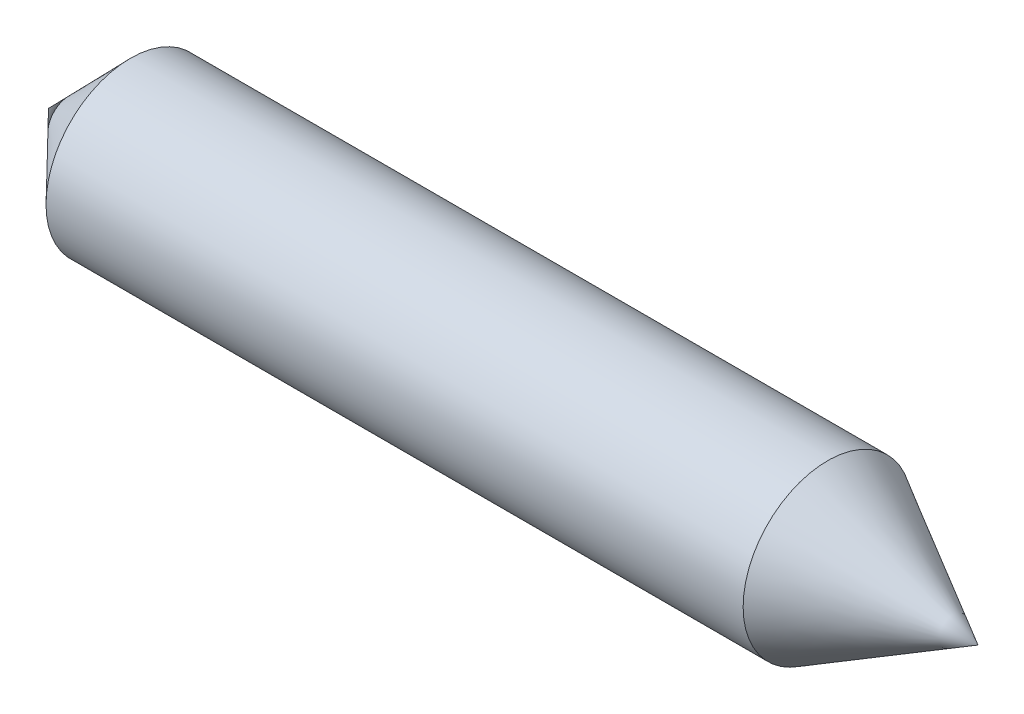
ISO-10303-21;
HEADER;
FILE_DESCRIPTION(('STEP AP214'),'2;1');
FILE_NAME('part.step','',(''),(''),'','','');
FILE_SCHEMA(('AUTOMOTIVE_DESIGN { 1 0 10303 214 1 1 1 1 }'));
ENDSEC;
DATA;
#1=APPLICATION_CONTEXT('core data for automotive mechanical design processes');
#2=APPLICATION_PROTOCOL_DEFINITION('international standard','automotive_design',2000,#1);
#3=PRODUCT_CONTEXT('',#1,'mechanical');
#4=PRODUCT('Part','Part','',(#3));
#5=PRODUCT_RELATED_PRODUCT_CATEGORY('part','',(#4));
#6=PRODUCT_DEFINITION_FORMATION('','',#4);
#7=PRODUCT_DEFINITION_CONTEXT('part definition',#1,'design');
#8=PRODUCT_DEFINITION('design','',#6,#7);
#9=PRODUCT_DEFINITION_SHAPE('','',#8);
#10=(LENGTH_UNIT() NAMED_UNIT(*) SI_UNIT(.MILLI.,.METRE.));
#11=(NAMED_UNIT(*) PLANE_ANGLE_UNIT() SI_UNIT($,.RADIAN.));
#12=(NAMED_UNIT(*) SI_UNIT($,.STERADIAN.) SOLID_ANGLE_UNIT());
#13=UNCERTAINTY_MEASURE_WITH_UNIT(LENGTH_MEASURE(1.E-05),#10,'distance_accuracy_value','');
#14=(GEOMETRIC_REPRESENTATION_CONTEXT(3) GLOBAL_UNCERTAINTY_ASSIGNED_CONTEXT((#13)) GLOBAL_UNIT_ASSIGNED_CONTEXT((#10,
#11,#12)) REPRESENTATION_CONTEXT('',''));
#15=CARTESIAN_POINT('',(0.,0.,0.));
#16=DIRECTION('',(0.,0.,1.));
#17=DIRECTION('',(1.,0.,0.));
#18=AXIS2_PLACEMENT_3D('',#15,#16,#17);
#19=CARTESIAN_POINT('',(-61.4092595220045,7.18483976992605,0.));
#20=DIRECTION('',(1.,0.,0.));
#21=DIRECTION('',(0.,0.,-1.));
#22=AXIS2_PLACEMENT_3D('',#19,#20,#21);
#23=CONICAL_SURFACE('',#22,18.178462804953,0.800319841448886);
#24=CARTESIAN_POINT('',(-79.0531529840006,7.18483976992605,0.));
#25=VERTEX_POINT('',#24);
#26=VERTEX_LOOP('',#25);
#27=FACE_BOUND('',#26,.T.);
#28=CARTESIAN_POINT('',(-61.4092595220045,7.18483976992605,0.));
#29=DIRECTION('',(-1.,0.,0.));
#30=DIRECTION('',(0.,0.,1.));
#31=AXIS2_PLACEMENT_3D('',#28,#29,#30);
#32=CIRCLE('',#31,18.178462804953);
#33=CARTESIAN_POINT('',(-61.4092595220045,7.18483976992605,18.178462804953));
#34=VERTEX_POINT('',#33);
#35=EDGE_CURVE('E11',#34,#34,#32,.T.);
#36=ORIENTED_EDGE('',*,*,#35,.T.);
#37=EDGE_LOOP('',(#36));
#38=FACE_BOUND('',#37,.T.);
#39=ADVANCED_FACE('F35',(#27,#38),#23,.T.);
#40=CARTESIAN_POINT('',(-79.0531529840006,7.18483976992605,0.));
#41=DIRECTION('',(-1.,0.,0.));
#42=DIRECTION('',(0.,0.,1.));
#43=AXIS2_PLACEMENT_3D('',#40,#41,#42);
#44=CYLINDRICAL_SURFACE('',#43,18.178462804953);
#45=ORIENTED_EDGE('',*,*,#35,.F.);
#46=EDGE_LOOP('',(#45));
#47=FACE_BOUND('',#46,.T.);
#48=CARTESIAN_POINT('',(88.5907404779955,7.18483976992605,0.));
#49=DIRECTION('',(-1.,0.,0.));
#50=DIRECTION('',(0.,0.,1.));
#51=AXIS2_PLACEMENT_3D('',#48,#49,#50);
#52=CIRCLE('',#51,18.178462804953);
#53=CARTESIAN_POINT('',(88.5907404779955,7.18483976992605,18.178462804953));
#54=VERTEX_POINT('',#53);
#55=EDGE_CURVE('E42',#54,#54,#52,.T.);
#56=ORIENTED_EDGE('',*,*,#55,.T.);
#57=EDGE_LOOP('',(#56));
#58=FACE_BOUND('',#57,.T.);
#59=ADVANCED_FACE('F50',(#47,#58),#44,.T.);
#60=CARTESIAN_POINT('',(120.946847015999,7.18483976992605,0.));
#61=DIRECTION('',(-1.,0.,0.));
#62=DIRECTION('',(0.,0.,1.));
#63=AXIS2_PLACEMENT_3D('',#60,#61,#62);
#64=CONICAL_SURFACE('',#63,0.,0.511876394192102);
#65=ORIENTED_EDGE('',*,*,#55,.F.);
#66=EDGE_LOOP('',(#65));
#67=FACE_BOUND('',#66,.T.);
#68=CARTESIAN_POINT('',(120.946847015999,7.18483976992605,0.));
#69=VERTEX_POINT('',#68);
#70=VERTEX_LOOP('',#69);
#71=FACE_BOUND('',#70,.T.);
#72=ADVANCED_FACE('F55',(#67,#71),#64,.T.);
#73=CLOSED_SHELL('',(#39,#59,#72));
#74=MANIFOLD_SOLID_BREP('B2',#73);
#75=ADVANCED_BREP_SHAPE_REPRESENTATION('',(#18,#74),#14);
#76=SHAPE_DEFINITION_REPRESENTATION(#9,#75);
ENDSEC;
END-ISO-10303-21;
